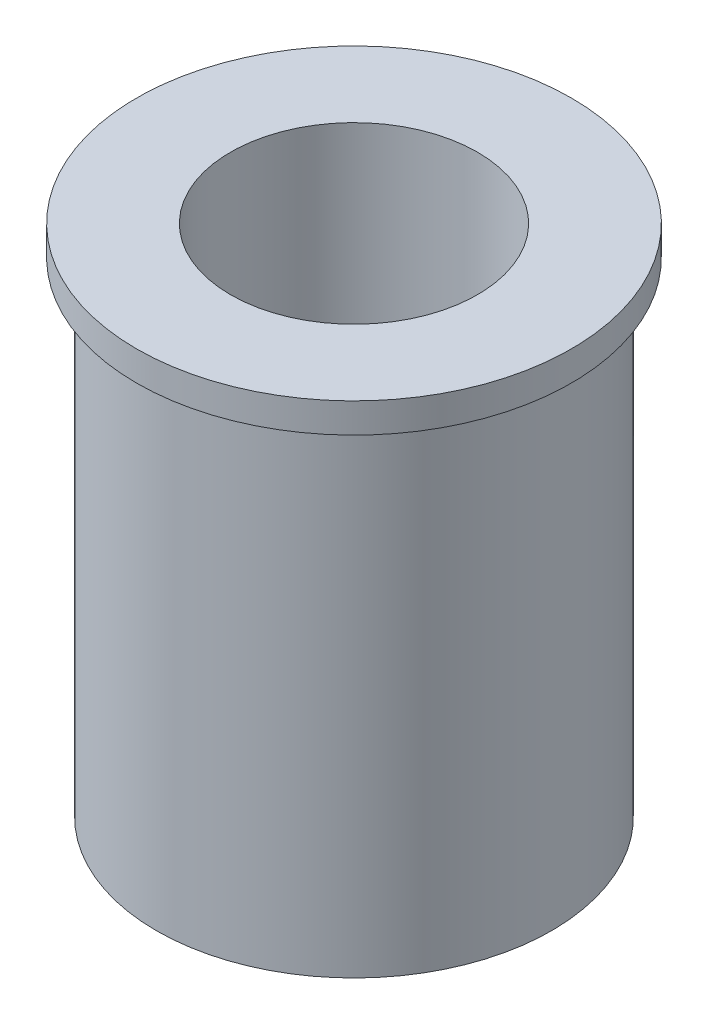
ISO-10303-21;
HEADER;
FILE_DESCRIPTION(('STEP AP214'),'2;1');
FILE_NAME('part.step','',(''),(''),'','','');
FILE_SCHEMA(('AUTOMOTIVE_DESIGN { 1 0 10303 214 1 1 1 1 }'));
ENDSEC;
DATA;
#1=APPLICATION_CONTEXT('core data for automotive mechanical design processes');
#2=APPLICATION_PROTOCOL_DEFINITION('international standard','automotive_design',2000,#1);
#3=PRODUCT_CONTEXT('',#1,'mechanical');
#4=PRODUCT('Part','Part','',(#3));
#5=PRODUCT_RELATED_PRODUCT_CATEGORY('part','',(#4));
#6=PRODUCT_DEFINITION_FORMATION('','',#4);
#7=PRODUCT_DEFINITION_CONTEXT('part definition',#1,'design');
#8=PRODUCT_DEFINITION('design','',#6,#7);
#9=PRODUCT_DEFINITION_SHAPE('','',#8);
#10=(LENGTH_UNIT() NAMED_UNIT(*) SI_UNIT(.MILLI.,.METRE.));
#11=(NAMED_UNIT(*) PLANE_ANGLE_UNIT() SI_UNIT($,.RADIAN.));
#12=(NAMED_UNIT(*) SI_UNIT($,.STERADIAN.) SOLID_ANGLE_UNIT());
#13=UNCERTAINTY_MEASURE_WITH_UNIT(LENGTH_MEASURE(1.E-05),#10,'distance_accuracy_value','');
#14=(GEOMETRIC_REPRESENTATION_CONTEXT(3) GLOBAL_UNCERTAINTY_ASSIGNED_CONTEXT((#13)) GLOBAL_UNIT_ASSIGNED_CONTEXT((#10,
#11,#12)) REPRESENTATION_CONTEXT('',''));
#15=CARTESIAN_POINT('',(0.,0.,0.));
#16=DIRECTION('',(0.,0.,1.));
#17=DIRECTION('',(1.,0.,0.));
#18=AXIS2_PLACEMENT_3D('',#15,#16,#17);
#19=CARTESIAN_POINT('',(0.,0.,0.));
#20=DIRECTION('',(0.,1.,0.));
#21=DIRECTION('',(0.,0.,1.));
#22=AXIS2_PLACEMENT_3D('',#19,#20,#21);
#23=PLANE('',#22);
#24=CARTESIAN_POINT('',(0.,0.,0.));
#25=DIRECTION('',(0.,1.,0.));
#26=DIRECTION('',(0.,0.,1.));
#27=AXIS2_PLACEMENT_3D('',#24,#25,#26);
#28=CIRCLE('',#27,2.);
#29=CARTESIAN_POINT('',(0.,0.,2.));
#30=VERTEX_POINT('',#29);
#31=EDGE_CURVE('E38',#30,#30,#28,.T.);
#32=ORIENTED_EDGE('',*,*,#31,.F.);
#33=EDGE_LOOP('',(#32));
#34=FACE_BOUND('',#33,.T.);
#35=CARTESIAN_POINT('',(0.,0.,0.));
#36=DIRECTION('',(0.,1.,0.));
#37=DIRECTION('',(0.,0.,1.));
#38=AXIS2_PLACEMENT_3D('',#35,#36,#37);
#39=CIRCLE('',#38,1.25);
#40=CARTESIAN_POINT('',(0.,0.,1.25));
#41=VERTEX_POINT('',#40);
#42=EDGE_CURVE('E45',#41,#41,#39,.T.);
#43=ORIENTED_EDGE('',*,*,#42,.T.);
#44=EDGE_LOOP('',(#43));
#45=FACE_BOUND('',#44,.T.);
#46=ADVANCED_FACE('F34',(#34,#45),#23,.F.);
#47=CARTESIAN_POINT('',(0.,4.9,0.));
#48=DIRECTION('',(0.,-1.,0.));
#49=DIRECTION('',(0.,0.,-1.));
#50=AXIS2_PLACEMENT_3D('',#47,#48,#49);
#51=CYLINDRICAL_SURFACE('',#50,2.);
#52=CARTESIAN_POINT('',(0.,4.9,0.));
#53=DIRECTION('',(0.,1.,0.));
#54=DIRECTION('',(0.,0.,1.));
#55=AXIS2_PLACEMENT_3D('',#52,#53,#54);
#56=CIRCLE('',#55,2.);
#57=CARTESIAN_POINT('',(0.,4.9,2.));
#58=VERTEX_POINT('',#57);
#59=EDGE_CURVE('E10',#58,#58,#56,.T.);
#60=ORIENTED_EDGE('',*,*,#59,.F.);
#61=EDGE_LOOP('',(#60));
#62=FACE_BOUND('',#61,.T.);
#63=ORIENTED_EDGE('',*,*,#31,.T.);
#64=EDGE_LOOP('',(#63));
#65=FACE_BOUND('',#64,.T.);
#66=ADVANCED_FACE('F36',(#62,#65),#51,.T.);
#67=CARTESIAN_POINT('',(0.,4.9,0.));
#68=DIRECTION('',(0.,-1.,0.));
#69=DIRECTION('',(0.,0.,-1.));
#70=AXIS2_PLACEMENT_3D('',#67,#68,#69);
#71=CYLINDRICAL_SURFACE('',#70,1.25);
#72=ORIENTED_EDGE('',*,*,#42,.F.);
#73=EDGE_LOOP('',(#72));
#74=FACE_BOUND('',#73,.T.);
#75=CARTESIAN_POINT('',(0.,5.2,0.));
#76=DIRECTION('',(0.,1.,0.));
#77=DIRECTION('',(0.,0.,1.));
#78=AXIS2_PLACEMENT_3D('',#75,#76,#77);
#79=CIRCLE('',#78,1.25);
#80=CARTESIAN_POINT('',(0.,5.2,1.25));
#81=VERTEX_POINT('',#80);
#82=EDGE_CURVE('E53',#81,#81,#79,.T.);
#83=ORIENTED_EDGE('',*,*,#82,.T.);
#84=EDGE_LOOP('',(#83));
#85=FACE_BOUND('',#84,.T.);
#86=ADVANCED_FACE('F59',(#74,#85),#71,.F.);
#87=CARTESIAN_POINT('',(0.,5.2,0.));
#88=DIRECTION('',(0.,1.,0.));
#89=DIRECTION('',(0.,0.,1.));
#90=AXIS2_PLACEMENT_3D('',#87,#88,#89);
#91=PLANE('',#90);
#92=CARTESIAN_POINT('',(0.,5.2,0.));
#93=DIRECTION('',(0.,1.,0.));
#94=DIRECTION('',(0.,0.,1.));
#95=AXIS2_PLACEMENT_3D('',#92,#93,#94);
#96=CIRCLE('',#95,2.2);
#97=CARTESIAN_POINT('',(0.,5.2,2.2));
#98=VERTEX_POINT('',#97);
#99=EDGE_CURVE('E49',#98,#98,#96,.T.);
#100=ORIENTED_EDGE('',*,*,#99,.T.);
#101=EDGE_LOOP('',(#100));
#102=FACE_BOUND('',#101,.T.);
#103=ORIENTED_EDGE('',*,*,#82,.F.);
#104=EDGE_LOOP('',(#103));
#105=FACE_BOUND('',#104,.T.);
#106=ADVANCED_FACE('F61',(#102,#105),#91,.T.);
#107=CARTESIAN_POINT('',(0.,4.9,0.));
#108=DIRECTION('',(0.,1.,0.));
#109=DIRECTION('',(0.,0.,1.));
#110=AXIS2_PLACEMENT_3D('',#107,#108,#109);
#111=PLANE('',#110);
#112=ORIENTED_EDGE('',*,*,#59,.T.);
#113=EDGE_LOOP('',(#112));
#114=FACE_BOUND('',#113,.T.);
#115=CARTESIAN_POINT('',(0.,4.9,0.));
#116=DIRECTION('',(0.,1.,0.));
#117=DIRECTION('',(0.,0.,1.));
#118=AXIS2_PLACEMENT_3D('',#115,#116,#117);
#119=CIRCLE('',#118,2.2);
#120=CARTESIAN_POINT('',(0.,4.9,2.2));
#121=VERTEX_POINT('',#120);
#122=EDGE_CURVE('E50',#121,#121,#119,.T.);
#123=ORIENTED_EDGE('',*,*,#122,.F.);
#124=EDGE_LOOP('',(#123));
#125=FACE_BOUND('',#124,.T.);
#126=ADVANCED_FACE('F63',(#114,#125),#111,.F.);
#127=CARTESIAN_POINT('',(0.,5.2,0.));
#128=DIRECTION('',(0.,-1.,0.));
#129=DIRECTION('',(0.,0.,-1.));
#130=AXIS2_PLACEMENT_3D('',#127,#128,#129);
#131=CYLINDRICAL_SURFACE('',#130,2.2);
#132=ORIENTED_EDGE('',*,*,#99,.F.);
#133=EDGE_LOOP('',(#132));
#134=FACE_BOUND('',#133,.T.);
#135=ORIENTED_EDGE('',*,*,#122,.T.);
#136=EDGE_LOOP('',(#135));
#137=FACE_BOUND('',#136,.T.);
#138=ADVANCED_FACE('F70',(#134,#137),#131,.T.);
#139=CLOSED_SHELL('',(#46,#66,#86,#106,#126,#138));
#140=MANIFOLD_SOLID_BREP('B2',#139);
#141=ADVANCED_BREP_SHAPE_REPRESENTATION('',(#18,#140),#14);
#142=SHAPE_DEFINITION_REPRESENTATION(#9,#141);
ENDSEC;
END-ISO-10303-21;
